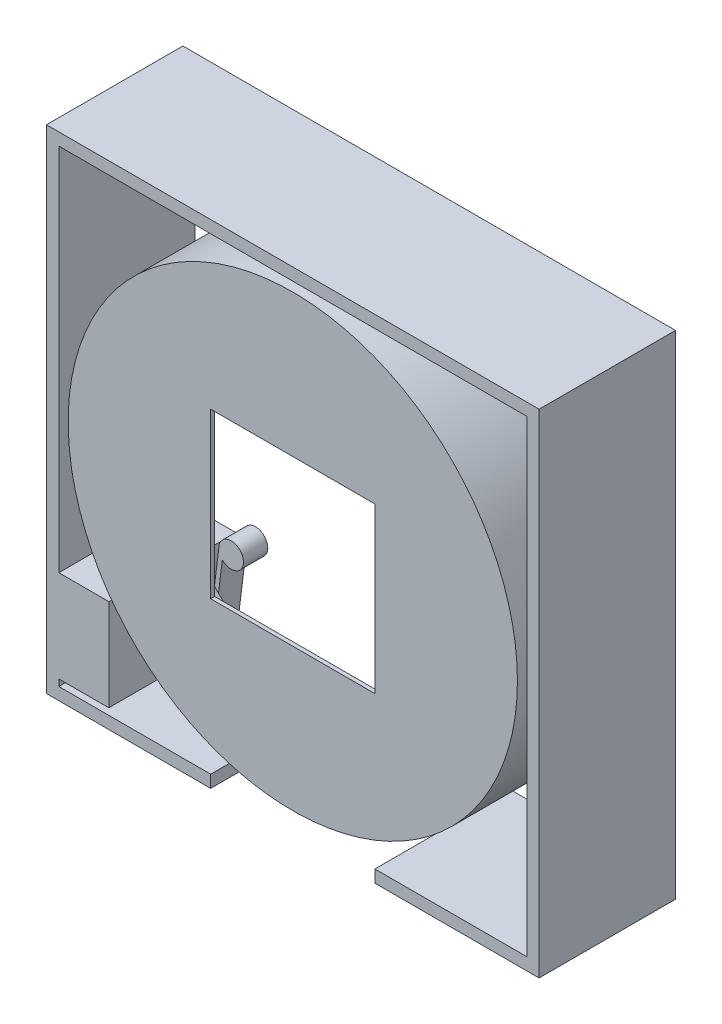
ISO-10303-21;
HEADER;
FILE_DESCRIPTION(('STEP AP214'),'2;1');
FILE_NAME('part.step','',(''),(''),'','','');
FILE_SCHEMA(('AUTOMOTIVE_DESIGN { 1 0 10303 214 1 1 1 1 }'));
ENDSEC;
DATA;
#1=APPLICATION_CONTEXT('core data for automotive mechanical design processes');
#2=APPLICATION_PROTOCOL_DEFINITION('international standard','automotive_design',2000,#1);
#3=PRODUCT_CONTEXT('',#1,'mechanical');
#4=PRODUCT('Part','Part','',(#3));
#5=PRODUCT_RELATED_PRODUCT_CATEGORY('part','',(#4));
#6=PRODUCT_DEFINITION_FORMATION('','',#4);
#7=PRODUCT_DEFINITION_CONTEXT('part definition',#1,'design');
#8=PRODUCT_DEFINITION('design','',#6,#7);
#9=PRODUCT_DEFINITION_SHAPE('','',#8);
#10=(LENGTH_UNIT() NAMED_UNIT(*) SI_UNIT(.MILLI.,.METRE.));
#11=(NAMED_UNIT(*) PLANE_ANGLE_UNIT() SI_UNIT($,.RADIAN.));
#12=(NAMED_UNIT(*) SI_UNIT($,.STERADIAN.) SOLID_ANGLE_UNIT());
#13=UNCERTAINTY_MEASURE_WITH_UNIT(LENGTH_MEASURE(1.E-05),#10,'distance_accuracy_value','');
#14=(GEOMETRIC_REPRESENTATION_CONTEXT(3) GLOBAL_UNCERTAINTY_ASSIGNED_CONTEXT((#13)) GLOBAL_UNIT_ASSIGNED_CONTEXT((#10,
#11,#12)) REPRESENTATION_CONTEXT('',''));
#15=CARTESIAN_POINT('',(0.,0.,0.));
#16=DIRECTION('',(0.,0.,1.));
#17=DIRECTION('',(1.,0.,0.));
#18=AXIS2_PLACEMENT_3D('',#15,#16,#17);
#19=CARTESIAN_POINT('',(0.,0.,-19.1379230769231));
#20=DIRECTION('',(0.,0.,1.));
#21=DIRECTION('',(1.,0.,0.));
#22=AXIS2_PLACEMENT_3D('',#19,#20,#21);
#23=PLANE('',#22);
#24=DIRECTION('',(0.,-1.,0.));
#25=VECTOR('',#24,1.);
#26=CARTESIAN_POINT('',(-44.98975,0.,-19.1379230769231));
#27=LINE('',#26,#25);
#28=CARTESIAN_POINT('',(-44.98975,-26.19375,-19.1379230769231));
#29=VERTEX_POINT('',#28);
#30=CARTESIAN_POINT('',(-44.98975,-43.97375,-19.1379230769231));
#31=VERTEX_POINT('',#30);
#32=EDGE_CURVE('E62',#29,#31,#27,.T.);
#33=ORIENTED_EDGE('',*,*,#32,.T.);
#34=DIRECTION('',(1.,0.,0.));
#35=VECTOR('',#34,1.);
#36=CARTESIAN_POINT('',(-45.24375,-43.97375,-19.1379230769231));
#37=LINE('',#36,#35);
#38=CARTESIAN_POINT('',(-45.24375,-43.97375,-19.1379230769231));
#39=VERTEX_POINT('',#38);
#40=EDGE_CURVE('E273',#39,#31,#37,.T.);
#41=ORIENTED_EDGE('',*,*,#40,.F.);
#42=DIRECTION('',(0.,-1.,0.));
#43=VECTOR('',#42,1.);
#44=CARTESIAN_POINT('',(-45.24375,-26.19375,-19.1379230769231));
#45=LINE('',#44,#43);
#46=CARTESIAN_POINT('',(-45.24375,-26.19375,-19.1379230769231));
#47=VERTEX_POINT('',#46);
#48=EDGE_CURVE('E277',#47,#39,#45,.T.);
#49=ORIENTED_EDGE('',*,*,#48,.F.);
#50=DIRECTION('',(-1.,0.,0.));
#51=VECTOR('',#50,1.);
#52=CARTESIAN_POINT('',(-45.24375,-26.19375,-19.1379230769231));
#53=LINE('',#52,#51);
#54=EDGE_CURVE('E268',#29,#47,#53,.T.);
#55=ORIENTED_EDGE('',*,*,#54,.F.);
#56=EDGE_LOOP('',(#33,#41,#49,#55));
#57=FACE_BOUND('',#56,.T.);
#58=ADVANCED_FACE('F45',(#57),#23,.F.);
#59=CARTESIAN_POINT('',(-45.24375,-45.24375,-26.3769230769231));
#60=DIRECTION('',(1.,0.,0.));
#61=DIRECTION('',(0.,1.,0.));
#62=AXIS2_PLACEMENT_3D('',#59,#60,#61);
#63=PLANE('',#62);
#64=ORIENTED_EDGE('',*,*,#48,.T.);
#65=DIRECTION('',(0.,0.,-1.));
#66=VECTOR('',#65,1.);
#67=CARTESIAN_POINT('',(-45.24375,-43.97375,20.2431182720658));
#68=LINE('',#67,#66);
#69=CARTESIAN_POINT('',(-45.24375,-43.97375,0.));
#70=VERTEX_POINT('',#69);
#71=EDGE_CURVE('E276',#70,#39,#68,.T.);
#72=ORIENTED_EDGE('',*,*,#71,.F.);
#73=DIRECTION('',(0.,1.,0.));
#74=VECTOR('',#73,1.);
#75=CARTESIAN_POINT('',(-45.24375,-45.24375,0.));
#76=LINE('',#75,#74);
#77=CARTESIAN_POINT('',(-45.24375,-45.24375,0.));
#78=VERTEX_POINT('',#77);
#79=EDGE_CURVE('E340',#78,#70,#76,.T.);
#80=ORIENTED_EDGE('',*,*,#79,.F.);
#81=DIRECTION('',(0.,0.,1.));
#82=VECTOR('',#81,1.);
#83=CARTESIAN_POINT('',(-45.24375,-45.24375,-26.3769230769231));
#84=LINE('',#83,#82);
#85=CARTESIAN_POINT('',(-45.24375,-45.24375,-26.3769230769231));
#86=VERTEX_POINT('',#85);
#87=EDGE_CURVE('E367',#86,#78,#84,.T.);
#88=ORIENTED_EDGE('',*,*,#87,.F.);
#89=DIRECTION('',(0.,1.,0.));
#90=VECTOR('',#89,1.);
#91=CARTESIAN_POINT('',(-45.24375,-45.24375,-26.3769230769231));
#92=LINE('',#91,#90);
#93=CARTESIAN_POINT('',(-45.24375,45.24375,-26.3769230769231));
#94=VERTEX_POINT('',#93);
#95=EDGE_CURVE('E309',#86,#94,#92,.T.);
#96=ORIENTED_EDGE('',*,*,#95,.T.);
#97=DIRECTION('',(0.,0.,1.));
#98=VECTOR('',#97,1.);
#99=CARTESIAN_POINT('',(-45.24375,45.24375,-26.3769230769231));
#100=LINE('',#99,#98);
#101=CARTESIAN_POINT('',(-45.24375,45.24375,0.));
#102=VERTEX_POINT('',#101);
#103=EDGE_CURVE('E364',#94,#102,#100,.T.);
#104=ORIENTED_EDGE('',*,*,#103,.T.);
#105=CARTESIAN_POINT('',(-45.24375,-26.19375,0.));
#106=VERTEX_POINT('',#105);
#107=EDGE_CURVE('E339',#106,#102,#76,.T.);
#108=ORIENTED_EDGE('',*,*,#107,.F.);
#109=DIRECTION('',(0.,0.,-1.));
#110=VECTOR('',#109,1.);
#111=CARTESIAN_POINT('',(-45.24375,-26.19375,20.2431182720658));
#112=LINE('',#111,#110);
#113=EDGE_CURVE('E259',#106,#47,#112,.T.);
#114=ORIENTED_EDGE('',*,*,#113,.T.);
#115=EDGE_LOOP('',(#64,#72,#80,#88,#96,#104,#108,#114));
#116=FACE_BOUND('',#115,.T.);
#117=ADVANCED_FACE('F416',(#116),#63,.T.);
#118=CARTESIAN_POINT('',(47.625,-47.625,-26.3769230769231));
#119=DIRECTION('',(1.,0.,0.));
#120=DIRECTION('',(0.,0.,-1.));
#121=AXIS2_PLACEMENT_3D('',#118,#119,#120);
#122=PLANE('',#121);
#123=DIRECTION('',(0.,1.,0.));
#124=VECTOR('',#123,1.);
#125=CARTESIAN_POINT('',(47.625,-47.625,0.));
#126=LINE('',#125,#124);
#127=CARTESIAN_POINT('',(47.625,-47.625,0.));
#128=VERTEX_POINT('',#127);
#129=CARTESIAN_POINT('',(47.625,47.625,0.));
#130=VERTEX_POINT('',#129);
#131=EDGE_CURVE('E282',#128,#130,#126,.T.);
#132=ORIENTED_EDGE('',*,*,#131,.F.);
#133=DIRECTION('',(0.,0.,1.));
#134=VECTOR('',#133,1.);
#135=CARTESIAN_POINT('',(47.625,-47.625,-26.3769230769231));
#136=LINE('',#135,#134);
#137=CARTESIAN_POINT('',(47.625,-47.625,-26.3769230769231));
#138=VERTEX_POINT('',#137);
#139=EDGE_CURVE('E12',#138,#128,#136,.T.);
#140=ORIENTED_EDGE('',*,*,#139,.F.);
#141=DIRECTION('',(0.,1.,0.));
#142=VECTOR('',#141,1.);
#143=CARTESIAN_POINT('',(47.625,-47.625,-26.3769230769231));
#144=LINE('',#143,#142);
#145=CARTESIAN_POINT('',(47.625,47.625,-26.3769230769231));
#146=VERTEX_POINT('',#145);
#147=EDGE_CURVE('E293',#138,#146,#144,.T.);
#148=ORIENTED_EDGE('',*,*,#147,.T.);
#149=DIRECTION('',(0.,0.,1.));
#150=VECTOR('',#149,1.);
#151=CARTESIAN_POINT('',(47.625,47.625,-26.3769230769231));
#152=LINE('',#151,#150);
#153=EDGE_CURVE('E49',#146,#130,#152,.T.);
#154=ORIENTED_EDGE('',*,*,#153,.T.);
#155=EDGE_LOOP('',(#132,#140,#148,#154));
#156=FACE_BOUND('',#155,.T.);
#157=ADVANCED_FACE('F47',(#156),#122,.T.);
#158=CARTESIAN_POINT('',(47.625,-47.625,-26.3769230769231));
#159=DIRECTION('',(0.,1.,0.));
#160=DIRECTION('',(0.,0.,1.));
#161=AXIS2_PLACEMENT_3D('',#158,#159,#160);
#162=PLANE('',#161);
#163=DIRECTION('',(-1.,0.,0.));
#164=VECTOR('',#163,1.);
#165=CARTESIAN_POINT('',(47.625,-47.625,0.));
#166=LINE('',#165,#164);
#167=CARTESIAN_POINT('',(15.875,-47.625,0.));
#168=VERTEX_POINT('',#167);
#169=EDGE_CURVE('E297',#128,#168,#166,.T.);
#170=ORIENTED_EDGE('',*,*,#169,.T.);
#171=DIRECTION('',(0.,0.,1.));
#172=VECTOR('',#171,1.);
#173=CARTESIAN_POINT('',(15.875,-47.625,-26.3769230769231));
#174=LINE('',#173,#172);
#175=CARTESIAN_POINT('',(15.875,-47.625,-26.3769230769231));
#176=VERTEX_POINT('',#175);
#177=EDGE_CURVE('E54',#176,#168,#174,.T.);
#178=ORIENTED_EDGE('',*,*,#177,.F.);
#179=DIRECTION('',(-1.,0.,0.));
#180=VECTOR('',#179,1.);
#181=CARTESIAN_POINT('',(47.625,-47.625,-26.3769230769231));
#182=LINE('',#181,#180);
#183=EDGE_CURVE('E322',#138,#176,#182,.T.);
#184=ORIENTED_EDGE('',*,*,#183,.F.);
#185=ORIENTED_EDGE('',*,*,#139,.T.);
#186=EDGE_LOOP('',(#170,#178,#184,#185));
#187=FACE_BOUND('',#186,.T.);
#188=ADVANCED_FACE('F391',(#187),#162,.F.);
#189=CARTESIAN_POINT('',(15.875,-45.24375,-26.3769230769231));
#190=DIRECTION('',(-1.,0.,0.));
#191=DIRECTION('',(0.,0.,1.));
#192=AXIS2_PLACEMENT_3D('',#189,#190,#191);
#193=PLANE('',#192);
#194=DIRECTION('',(0.,-1.,0.));
#195=VECTOR('',#194,1.);
#196=CARTESIAN_POINT('',(15.875,-45.24375,0.));
#197=LINE('',#196,#195);
#198=CARTESIAN_POINT('',(15.875,-45.24375,0.));
#199=VERTEX_POINT('',#198);
#200=EDGE_CURVE('E351',#199,#168,#197,.T.);
#201=ORIENTED_EDGE('',*,*,#200,.F.);
#202=DIRECTION('',(0.,0.,1.));
#203=VECTOR('',#202,1.);
#204=CARTESIAN_POINT('',(15.875,-45.24375,-26.3769230769231));
#205=LINE('',#204,#203);
#206=CARTESIAN_POINT('',(15.875,-45.24375,-26.3769230769231));
#207=VERTEX_POINT('',#206);
#208=EDGE_CURVE('E357',#207,#199,#205,.T.);
#209=ORIENTED_EDGE('',*,*,#208,.F.);
#210=DIRECTION('',(0.,-1.,0.));
#211=VECTOR('',#210,1.);
#212=CARTESIAN_POINT('',(15.875,-45.24375,-26.3769230769231));
#213=LINE('',#212,#211);
#214=EDGE_CURVE('E319',#207,#176,#213,.T.);
#215=ORIENTED_EDGE('',*,*,#214,.T.);
#216=ORIENTED_EDGE('',*,*,#177,.T.);
#217=EDGE_LOOP('',(#201,#209,#215,#216));
#218=FACE_BOUND('',#217,.T.);
#219=ADVANCED_FACE('F607',(#218),#193,.T.);
#220=CARTESIAN_POINT('',(45.24375,-45.24375,-26.3769230769231));
#221=DIRECTION('',(0.,1.,0.));
#222=DIRECTION('',(0.,0.,1.));
#223=AXIS2_PLACEMENT_3D('',#220,#221,#222);
#224=PLANE('',#223);
#225=DIRECTION('',(-1.,0.,0.));
#226=VECTOR('',#225,1.);
#227=CARTESIAN_POINT('',(45.24375,-45.24375,0.));
#228=LINE('',#227,#226);
#229=CARTESIAN_POINT('',(45.24375,-45.24375,0.));
#230=VERTEX_POINT('',#229);
#231=EDGE_CURVE('E348',#230,#199,#228,.T.);
#232=ORIENTED_EDGE('',*,*,#231,.F.);
#233=DIRECTION('',(0.,0.,1.));
#234=VECTOR('',#233,1.);
#235=CARTESIAN_POINT('',(45.24375,-45.24375,-26.3769230769231));
#236=LINE('',#235,#234);
#237=CARTESIAN_POINT('',(45.24375,-45.24375,-26.3769230769231));
#238=VERTEX_POINT('',#237);
#239=EDGE_CURVE('E359',#238,#230,#236,.T.);
#240=ORIENTED_EDGE('',*,*,#239,.F.);
#241=DIRECTION('',(-1.,0.,0.));
#242=VECTOR('',#241,1.);
#243=CARTESIAN_POINT('',(45.24375,-45.24375,-26.3769230769231));
#244=LINE('',#243,#242);
#245=EDGE_CURVE('E316',#238,#207,#244,.T.);
#246=ORIENTED_EDGE('',*,*,#245,.T.);
#247=ORIENTED_EDGE('',*,*,#208,.T.);
#248=EDGE_LOOP('',(#232,#240,#246,#247));
#249=FACE_BOUND('',#248,.T.);
#250=ADVANCED_FACE('F598',(#249),#224,.T.);
#251=CARTESIAN_POINT('',(45.24375,-45.24375,-26.3769230769231));
#252=DIRECTION('',(1.,0.,0.));
#253=DIRECTION('',(0.,0.,-1.));
#254=AXIS2_PLACEMENT_3D('',#251,#252,#253);
#255=PLANE('',#254);
#256=DIRECTION('',(0.,1.,0.));
#257=VECTOR('',#256,1.);
#258=CARTESIAN_POINT('',(45.24375,-45.24375,0.));
#259=LINE('',#258,#257);
#260=CARTESIAN_POINT('',(45.24375,45.24375,0.));
#261=VERTEX_POINT('',#260);
#262=EDGE_CURVE('E346',#230,#261,#259,.T.);
#263=ORIENTED_EDGE('',*,*,#262,.T.);
#264=DIRECTION('',(0.,0.,1.));
#265=VECTOR('',#264,1.);
#266=CARTESIAN_POINT('',(45.24375,45.24375,-26.3769230769231));
#267=LINE('',#266,#265);
#268=CARTESIAN_POINT('',(45.24375,45.24375,-26.3769230769231));
#269=VERTEX_POINT('',#268);
#270=EDGE_CURVE('E361',#269,#261,#267,.T.);
#271=ORIENTED_EDGE('',*,*,#270,.F.);
#272=DIRECTION('',(0.,1.,0.));
#273=VECTOR('',#272,1.);
#274=CARTESIAN_POINT('',(45.24375,-45.24375,-26.3769230769231));
#275=LINE('',#274,#273);
#276=EDGE_CURVE('E314',#238,#269,#275,.T.);
#277=ORIENTED_EDGE('',*,*,#276,.F.);
#278=ORIENTED_EDGE('',*,*,#239,.T.);
#279=EDGE_LOOP('',(#263,#271,#277,#278));
#280=FACE_BOUND('',#279,.T.);
#281=ADVANCED_FACE('F589',(#280),#255,.F.);
#282=CARTESIAN_POINT('',(45.24375,45.24375,-26.3769230769231));
#283=DIRECTION('',(0.,1.,0.));
#284=DIRECTION('',(-1.,0.,0.));
#285=AXIS2_PLACEMENT_3D('',#282,#283,#284);
#286=PLANE('',#285);
#287=DIRECTION('',(-1.,0.,0.));
#288=VECTOR('',#287,1.);
#289=CARTESIAN_POINT('',(45.24375,45.24375,0.));
#290=LINE('',#289,#288);
#291=EDGE_CURVE('E343',#261,#102,#290,.T.);
#292=ORIENTED_EDGE('',*,*,#291,.T.);
#293=ORIENTED_EDGE('',*,*,#103,.F.);
#294=DIRECTION('',(-1.,0.,0.));
#295=VECTOR('',#294,1.);
#296=CARTESIAN_POINT('',(45.24375,45.24375,-26.3769230769231));
#297=LINE('',#296,#295);
#298=EDGE_CURVE('E312',#269,#94,#297,.T.);
#299=ORIENTED_EDGE('',*,*,#298,.F.);
#300=ORIENTED_EDGE('',*,*,#270,.T.);
#301=EDGE_LOOP('',(#292,#293,#299,#300));
#302=FACE_BOUND('',#301,.T.);
#303=ADVANCED_FACE('F581',(#302),#286,.F.);
#304=CARTESIAN_POINT('',(-15.875,-45.24375,-26.3769230769231));
#305=DIRECTION('',(0.,1.,0.));
#306=DIRECTION('',(-1.,0.,0.));
#307=AXIS2_PLACEMENT_3D('',#304,#305,#306);
#308=PLANE('',#307);
#309=DIRECTION('',(-1.,0.,0.));
#310=VECTOR('',#309,1.);
#311=CARTESIAN_POINT('',(-15.875,-45.24375,0.));
#312=LINE('',#311,#310);
#313=CARTESIAN_POINT('',(-15.875,-45.24375,0.));
#314=VERTEX_POINT('',#313);
#315=EDGE_CURVE('E336',#314,#78,#312,.T.);
#316=ORIENTED_EDGE('',*,*,#315,.F.);
#317=DIRECTION('',(0.,0.,1.));
#318=VECTOR('',#317,1.);
#319=CARTESIAN_POINT('',(-15.875,-45.24375,-26.3769230769231));
#320=LINE('',#319,#318);
#321=CARTESIAN_POINT('',(-15.875,-45.24375,-26.3769230769231));
#322=VERTEX_POINT('',#321);
#323=EDGE_CURVE('E369',#322,#314,#320,.T.);
#324=ORIENTED_EDGE('',*,*,#323,.F.);
#325=DIRECTION('',(-1.,0.,0.));
#326=VECTOR('',#325,1.);
#327=CARTESIAN_POINT('',(-15.875,-45.24375,-26.3769230769231));
#328=LINE('',#327,#326);
#329=EDGE_CURVE('E306',#322,#86,#328,.T.);
#330=ORIENTED_EDGE('',*,*,#329,.T.);
#331=ORIENTED_EDGE('',*,*,#87,.T.);
#332=EDGE_LOOP('',(#316,#324,#330,#331));
#333=FACE_BOUND('',#332,.T.);
#334=ADVANCED_FACE('F412',(#333),#308,.T.);
#335=CARTESIAN_POINT('',(-15.875,-45.24375,-26.3769230769231));
#336=DIRECTION('',(-1.,0.,0.));
#337=DIRECTION('',(0.,0.,1.));
#338=AXIS2_PLACEMENT_3D('',#335,#336,#337);
#339=PLANE('',#338);
#340=DIRECTION('',(0.,-1.,0.));
#341=VECTOR('',#340,1.);
#342=CARTESIAN_POINT('',(-15.875,-45.24375,0.));
#343=LINE('',#342,#341);
#344=CARTESIAN_POINT('',(-15.875,-47.625,0.));
#345=VERTEX_POINT('',#344);
#346=EDGE_CURVE('E334',#314,#345,#343,.T.);
#347=ORIENTED_EDGE('',*,*,#346,.T.);
#348=DIRECTION('',(0.,0.,1.));
#349=VECTOR('',#348,1.);
#350=CARTESIAN_POINT('',(-15.875,-47.625,-26.3769230769231));
#351=LINE('',#350,#349);
#352=CARTESIAN_POINT('',(-15.875,-47.625,-26.3769230769231));
#353=VERTEX_POINT('',#352);
#354=EDGE_CURVE('E371',#353,#345,#351,.T.);
#355=ORIENTED_EDGE('',*,*,#354,.F.);
#356=DIRECTION('',(0.,-1.,0.));
#357=VECTOR('',#356,1.);
#358=CARTESIAN_POINT('',(-15.875,-45.24375,-26.3769230769231));
#359=LINE('',#358,#357);
#360=EDGE_CURVE('E304',#322,#353,#359,.T.);
#361=ORIENTED_EDGE('',*,*,#360,.F.);
#362=ORIENTED_EDGE('',*,*,#323,.T.);
#363=EDGE_LOOP('',(#347,#355,#361,#362));
#364=FACE_BOUND('',#363,.T.);
#365=ADVANCED_FACE('F409',(#364),#339,.F.);
#366=CARTESIAN_POINT('',(-15.875,-47.625,-26.3769230769231));
#367=DIRECTION('',(0.,1.,0.));
#368=DIRECTION('',(-1.,0.,0.));
#369=AXIS2_PLACEMENT_3D('',#366,#367,#368);
#370=PLANE('',#369);
#371=DIRECTION('',(-1.,0.,0.));
#372=VECTOR('',#371,1.);
#373=CARTESIAN_POINT('',(-15.875,-47.625,0.));
#374=LINE('',#373,#372);
#375=CARTESIAN_POINT('',(-47.625,-47.625,0.));
#376=VERTEX_POINT('',#375);
#377=EDGE_CURVE('E332',#345,#376,#374,.T.);
#378=ORIENTED_EDGE('',*,*,#377,.T.);
#379=DIRECTION('',(0.,0.,1.));
#380=VECTOR('',#379,1.);
#381=CARTESIAN_POINT('',(-47.625,-47.625,-26.3769230769231));
#382=LINE('',#381,#380);
#383=CARTESIAN_POINT('',(-47.625,-47.625,-26.3769230769231));
#384=VERTEX_POINT('',#383);
#385=EDGE_CURVE('E374',#384,#376,#382,.T.);
#386=ORIENTED_EDGE('',*,*,#385,.F.);
#387=DIRECTION('',(-1.,0.,0.));
#388=VECTOR('',#387,1.);
#389=CARTESIAN_POINT('',(-15.875,-47.625,-26.3769230769231));
#390=LINE('',#389,#388);
#391=EDGE_CURVE('E302',#353,#384,#390,.T.);
#392=ORIENTED_EDGE('',*,*,#391,.F.);
#393=ORIENTED_EDGE('',*,*,#354,.T.);
#394=EDGE_LOOP('',(#378,#386,#392,#393));
#395=FACE_BOUND('',#394,.T.);
#396=ADVANCED_FACE('F405',(#395),#370,.F.);
#397=CARTESIAN_POINT('',(-47.625,-47.625,-26.3769230769231));
#398=DIRECTION('',(1.,0.,0.));
#399=DIRECTION('',(0.,0.,-1.));
#400=AXIS2_PLACEMENT_3D('',#397,#398,#399);
#401=PLANE('',#400);
#402=DIRECTION('',(0.,1.,0.));
#403=VECTOR('',#402,1.);
#404=CARTESIAN_POINT('',(-47.625,-47.625,0.));
#405=LINE('',#404,#403);
#406=CARTESIAN_POINT('',(-47.625,47.625,0.));
#407=VERTEX_POINT('',#406);
#408=EDGE_CURVE('E329',#376,#407,#405,.T.);
#409=ORIENTED_EDGE('',*,*,#408,.T.);
#410=DIRECTION('',(0.,0.,1.));
#411=VECTOR('',#410,1.);
#412=CARTESIAN_POINT('',(-47.625,47.625,-26.3769230769231));
#413=LINE('',#412,#411);
#414=CARTESIAN_POINT('',(-47.625,47.625,-26.3769230769231));
#415=VERTEX_POINT('',#414);
#416=EDGE_CURVE('E376',#415,#407,#413,.T.);
#417=ORIENTED_EDGE('',*,*,#416,.F.);
#418=DIRECTION('',(0.,1.,0.));
#419=VECTOR('',#418,1.);
#420=CARTESIAN_POINT('',(-47.625,-47.625,-26.3769230769231));
#421=LINE('',#420,#419);
#422=EDGE_CURVE('E300',#384,#415,#421,.T.);
#423=ORIENTED_EDGE('',*,*,#422,.F.);
#424=ORIENTED_EDGE('',*,*,#385,.T.);
#425=EDGE_LOOP('',(#409,#417,#423,#424));
#426=FACE_BOUND('',#425,.T.);
#427=ADVANCED_FACE('F400',(#426),#401,.F.);
#428=CARTESIAN_POINT('',(47.625,47.625,-26.3769230769231));
#429=DIRECTION('',(0.,1.,0.));
#430=DIRECTION('',(-1.,0.,0.));
#431=AXIS2_PLACEMENT_3D('',#428,#429,#430);
#432=PLANE('',#431);
#433=DIRECTION('',(-1.,0.,0.));
#434=VECTOR('',#433,1.);
#435=CARTESIAN_POINT('',(47.625,47.625,0.));
#436=LINE('',#435,#434);
#437=EDGE_CURVE('E326',#130,#407,#436,.T.);
#438=ORIENTED_EDGE('',*,*,#437,.F.);
#439=ORIENTED_EDGE('',*,*,#153,.F.);
#440=DIRECTION('',(-1.,0.,0.));
#441=VECTOR('',#440,1.);
#442=CARTESIAN_POINT('',(47.625,47.625,-26.3769230769231));
#443=LINE('',#442,#441);
#444=EDGE_CURVE('E296',#146,#415,#443,.T.);
#445=ORIENTED_EDGE('',*,*,#444,.T.);
#446=ORIENTED_EDGE('',*,*,#416,.T.);
#447=EDGE_LOOP('',(#438,#439,#445,#446));
#448=FACE_BOUND('',#447,.T.);
#449=ADVANCED_FACE('F384',(#448),#432,.T.);
#450=CARTESIAN_POINT('',(0.,0.,-26.3769230769231));
#451=DIRECTION('',(0.,0.,1.));
#452=DIRECTION('',(1.,0.,0.));
#453=AXIS2_PLACEMENT_3D('',#450,#451,#452);
#454=PLANE('',#453);
#455=ORIENTED_EDGE('',*,*,#147,.F.);
#456=ORIENTED_EDGE('',*,*,#183,.T.);
#457=ORIENTED_EDGE('',*,*,#214,.F.);
#458=ORIENTED_EDGE('',*,*,#245,.F.);
#459=ORIENTED_EDGE('',*,*,#276,.T.);
#460=ORIENTED_EDGE('',*,*,#298,.T.);
#461=ORIENTED_EDGE('',*,*,#95,.F.);
#462=ORIENTED_EDGE('',*,*,#329,.F.);
#463=ORIENTED_EDGE('',*,*,#360,.T.);
#464=ORIENTED_EDGE('',*,*,#391,.T.);
#465=ORIENTED_EDGE('',*,*,#422,.T.);
#466=ORIENTED_EDGE('',*,*,#444,.F.);
#467=EDGE_LOOP('',(#455,#456,#457,#458,#459,#460,#461,#462,#463,#464,#465,#466));
#468=FACE_BOUND('',#467,.T.);
#469=ADVANCED_FACE('F395',(#468),#454,.F.);
#470=CARTESIAN_POINT('',(0.,0.,0.));
#471=DIRECTION('',(0.,0.,1.));
#472=DIRECTION('',(1.,0.,0.));
#473=AXIS2_PLACEMENT_3D('',#470,#471,#472);
#474=PLANE('',#473);
#475=ORIENTED_EDGE('',*,*,#131,.T.);
#476=ORIENTED_EDGE('',*,*,#437,.T.);
#477=ORIENTED_EDGE('',*,*,#408,.F.);
#478=ORIENTED_EDGE('',*,*,#377,.F.);
#479=ORIENTED_EDGE('',*,*,#346,.F.);
#480=ORIENTED_EDGE('',*,*,#315,.T.);
#481=ORIENTED_EDGE('',*,*,#79,.T.);
#482=DIRECTION('',(1.,0.,0.));
#483=VECTOR('',#482,1.);
#484=CARTESIAN_POINT('',(-45.24375,-43.97375,0.));
#485=LINE('',#484,#483);
#486=CARTESIAN_POINT('',(-35.566176059345,-43.97375,0.));
#487=VERTEX_POINT('',#486);
#488=EDGE_CURVE('E283',#70,#487,#485,.T.);
#489=ORIENTED_EDGE('',*,*,#488,.T.);
#490=DIRECTION('',(0.,1.,0.));
#491=VECTOR('',#490,1.);
#492=CARTESIAN_POINT('',(-35.566176059345,-26.19375,0.));
#493=LINE('',#492,#491);
#494=CARTESIAN_POINT('',(-35.566176059345,-26.19375,0.));
#495=VERTEX_POINT('',#494);
#496=EDGE_CURVE('E280',#487,#495,#493,.T.);
#497=ORIENTED_EDGE('',*,*,#496,.T.);
#498=DIRECTION('',(-1.,0.,0.));
#499=VECTOR('',#498,1.);
#500=CARTESIAN_POINT('',(-45.24375,-26.19375,0.));
#501=LINE('',#500,#499);
#502=EDGE_CURVE('E70',#495,#106,#501,.T.);
#503=ORIENTED_EDGE('',*,*,#502,.T.);
#504=ORIENTED_EDGE('',*,*,#107,.T.);
#505=ORIENTED_EDGE('',*,*,#291,.F.);
#506=ORIENTED_EDGE('',*,*,#262,.F.);
#507=ORIENTED_EDGE('',*,*,#231,.T.);
#508=ORIENTED_EDGE('',*,*,#200,.T.);
#509=ORIENTED_EDGE('',*,*,#169,.F.);
#510=EDGE_LOOP('',(#475,#476,#477,#478,#479,#480,#481,#489,#497,#503,#504,#505,#506,#507,#508,#509));
#511=FACE_BOUND('',#510,.T.);
#512=ADVANCED_FACE('F387',(#511),#474,.T.);
#513=CARTESIAN_POINT('',(-45.24375,-43.97375,20.2431182720658));
#514=DIRECTION('',(0.,1.,0.));
#515=DIRECTION('',(0.,0.,1.));
#516=AXIS2_PLACEMENT_3D('',#513,#514,#515);
#517=PLANE('',#516);
#518=ORIENTED_EDGE('',*,*,#488,.F.);
#519=ORIENTED_EDGE('',*,*,#71,.T.);
#520=ORIENTED_EDGE('',*,*,#40,.T.);
#521=DIRECTION('',(0.,0.,-1.));
#522=VECTOR('',#521,1.);
#523=CARTESIAN_POINT('',(-44.98975,-43.97375,-19.1379230769231));
#524=LINE('',#523,#522);
#525=CARTESIAN_POINT('',(-44.98975,-43.97375,-23.8369230769231));
#526=VERTEX_POINT('',#525);
#527=EDGE_CURVE('E257',#31,#526,#524,.T.);
#528=ORIENTED_EDGE('',*,*,#527,.T.);
#529=DIRECTION('',(-1.,0.,0.));
#530=VECTOR('',#529,1.);
#531=CARTESIAN_POINT('',(0.,-43.97375,-23.8369230769231));
#532=LINE('',#531,#530);
#533=CARTESIAN_POINT('',(-34.82975,-43.97375,-23.8369230769231));
#534=VERTEX_POINT('',#533);
#535=EDGE_CURVE('E254',#534,#526,#532,.T.);
#536=ORIENTED_EDGE('',*,*,#535,.F.);
#537=DIRECTION('',(0.,0.,-1.));
#538=VECTOR('',#537,1.);
#539=CARTESIAN_POINT('',(-34.82975,-43.97375,-19.1379230769231));
#540=LINE('',#539,#538);
#541=CARTESIAN_POINT('',(-34.82975,-43.97375,-19.1379230769231));
#542=VERTEX_POINT('',#541);
#543=EDGE_CURVE('E260',#542,#534,#540,.T.);
#544=ORIENTED_EDGE('',*,*,#543,.F.);
#545=DIRECTION('',(-1.,0.,0.));
#546=VECTOR('',#545,1.);
#547=CARTESIAN_POINT('',(0.,-43.97375,-19.1379230769231));
#548=LINE('',#547,#546);
#549=CARTESIAN_POINT('',(-35.566176059345,-43.97375,-19.1379230769231));
#550=VERTEX_POINT('',#549);
#551=EDGE_CURVE('E236',#542,#550,#548,.T.);
#552=ORIENTED_EDGE('',*,*,#551,.T.);
#553=DIRECTION('',(0.,0.,-1.));
#554=VECTOR('',#553,1.);
#555=CARTESIAN_POINT('',(-35.566176059345,-43.97375,20.2431182720658));
#556=LINE('',#555,#554);
#557=EDGE_CURVE('E272',#487,#550,#556,.T.);
#558=ORIENTED_EDGE('',*,*,#557,.F.);
#559=EDGE_LOOP('',(#518,#519,#520,#528,#536,#544,#552,#558));
#560=FACE_BOUND('',#559,.T.);
#561=ADVANCED_FACE('F421',(#560),#517,.F.);
#562=CARTESIAN_POINT('',(-35.566176059345,-26.19375,20.2431182720658));
#563=DIRECTION('',(-1.,0.,0.));
#564=DIRECTION('',(0.,0.,1.));
#565=AXIS2_PLACEMENT_3D('',#562,#563,#564);
#566=PLANE('',#565);
#567=ORIENTED_EDGE('',*,*,#496,.F.);
#568=ORIENTED_EDGE('',*,*,#557,.T.);
#569=DIRECTION('',(0.,1.,0.));
#570=VECTOR('',#569,1.);
#571=CARTESIAN_POINT('',(-35.566176059345,-26.19375,-19.1379230769231));
#572=LINE('',#571,#570);
#573=CARTESIAN_POINT('',(-35.566176059345,-26.19375,-19.1379230769231));
#574=VERTEX_POINT('',#573);
#575=EDGE_CURVE('E270',#550,#574,#572,.T.);
#576=ORIENTED_EDGE('',*,*,#575,.T.);
#577=DIRECTION('',(0.,0.,-1.));
#578=VECTOR('',#577,1.);
#579=CARTESIAN_POINT('',(-35.566176059345,-26.19375,20.2431182720658));
#580=LINE('',#579,#578);
#581=EDGE_CURVE('E218',#495,#574,#580,.T.);
#582=ORIENTED_EDGE('',*,*,#581,.F.);
#583=EDGE_LOOP('',(#567,#568,#576,#582));
#584=FACE_BOUND('',#583,.T.);
#585=ADVANCED_FACE('F438',(#584),#566,.F.);
#586=CARTESIAN_POINT('',(-45.24375,-26.19375,20.2431182720658));
#587=DIRECTION('',(0.,-1.,0.));
#588=DIRECTION('',(0.,0.,-1.));
#589=AXIS2_PLACEMENT_3D('',#586,#587,#588);
#590=PLANE('',#589);
#591=ORIENTED_EDGE('',*,*,#502,.F.);
#592=ORIENTED_EDGE('',*,*,#581,.T.);
#593=DIRECTION('',(-1.,0.,0.));
#594=VECTOR('',#593,1.);
#595=CARTESIAN_POINT('',(0.,-26.19375,-19.1379230769231));
#596=LINE('',#595,#594);
#597=CARTESIAN_POINT('',(-34.82975,-26.19375,-19.1379230769231));
#598=VERTEX_POINT('',#597);
#599=EDGE_CURVE('E216',#598,#574,#596,.T.);
#600=ORIENTED_EDGE('',*,*,#599,.F.);
#601=DIRECTION('',(0.,0.,-1.));
#602=VECTOR('',#601,1.);
#603=CARTESIAN_POINT('',(-34.82975,-26.19375,-19.1379230769231));
#604=LINE('',#603,#602);
#605=CARTESIAN_POINT('',(-34.82975,-26.19375,-23.8369230769231));
#606=VERTEX_POINT('',#605);
#607=EDGE_CURVE('E203',#598,#606,#604,.T.);
#608=ORIENTED_EDGE('',*,*,#607,.T.);
#609=DIRECTION('',(-1.,0.,0.));
#610=VECTOR('',#609,1.);
#611=CARTESIAN_POINT('',(0.,-26.19375,-23.8369230769231));
#612=LINE('',#611,#610);
#613=CARTESIAN_POINT('',(-44.98975,-26.19375,-23.8369230769231));
#614=VERTEX_POINT('',#613);
#615=EDGE_CURVE('E242',#606,#614,#612,.T.);
#616=ORIENTED_EDGE('',*,*,#615,.T.);
#617=DIRECTION('',(0.,0.,-1.));
#618=VECTOR('',#617,1.);
#619=CARTESIAN_POINT('',(-44.98975,-26.19375,-19.1379230769231));
#620=LINE('',#619,#618);
#621=EDGE_CURVE('E213',#29,#614,#620,.T.);
#622=ORIENTED_EDGE('',*,*,#621,.F.);
#623=ORIENTED_EDGE('',*,*,#54,.T.);
#624=ORIENTED_EDGE('',*,*,#113,.F.);
#625=EDGE_LOOP('',(#591,#592,#600,#608,#616,#622,#623,#624));
#626=FACE_BOUND('',#625,.T.);
#627=ADVANCED_FACE('F217',(#626),#590,.F.);
#628=CARTESIAN_POINT('',(0.,0.,-19.1379230769231));
#629=DIRECTION('',(0.,0.,-1.));
#630=DIRECTION('',(-1.,0.,0.));
#631=AXIS2_PLACEMENT_3D('',#628,#629,#630);
#632=PLANE('',#631);
#633=ORIENTED_EDGE('',*,*,#599,.T.);
#634=ORIENTED_EDGE('',*,*,#575,.F.);
#635=ORIENTED_EDGE('',*,*,#551,.F.);
#636=DIRECTION('',(0.123264387730611,0.992373866401871,0.));
#637=VECTOR('',#636,1.);
#638=CARTESIAN_POINT('',(-28.9214822767437,3.59238481161377,-19.1379230769231));
#639=LINE('',#638,#637);
#640=CARTESIAN_POINT('',(-32.765891315195,-27.3580878411687,-19.1379230769231));
#641=VERTEX_POINT('',#640);
#642=EDGE_CURVE('E234',#542,#641,#639,.T.);
#643=ORIENTED_EDGE('',*,*,#642,.T.);
#644=CARTESIAN_POINT('',(-31.0555301225557,-25.701278813787,-19.1379230769231));
#645=DIRECTION('',(0.,0.,-1.));
#646=DIRECTION('',(-1.,0.,0.));
#647=AXIS2_PLACEMENT_3D('',#644,#645,#646);
#648=CIRCLE('',#647,2.38125);
#649=CARTESIAN_POINT('',(-33.4367801225557,-25.701278813787,-19.1379230769231));
#650=VERTEX_POINT('',#649);
#651=EDGE_CURVE('E228',#650,#641,#648,.T.);
#652=ORIENTED_EDGE('',*,*,#651,.F.);
#653=DIRECTION('',(-0.123264387730611,-0.992373866401871,0.));
#654=VECTOR('',#653,1.);
#655=CARTESIAN_POINT('',(-29.7848456252645,3.6996245910432,-19.1379230769231));
#656=LINE('',#655,#654);
#657=CARTESIAN_POINT('',(-34.82975,-36.9157660514296,-19.1379230769231));
#658=VERTEX_POINT('',#657);
#659=EDGE_CURVE('E225',#650,#658,#656,.T.);
#660=ORIENTED_EDGE('',*,*,#659,.T.);
#661=DIRECTION('',(0.,-1.,0.));
#662=VECTOR('',#661,1.);
#663=CARTESIAN_POINT('',(-34.82975,0.,-19.1379230769231));
#664=LINE('',#663,#662);
#665=EDGE_CURVE('E207',#598,#658,#664,.T.);
#666=ORIENTED_EDGE('',*,*,#665,.F.);
#667=EDGE_LOOP('',(#633,#634,#635,#643,#652,#660,#666));
#668=FACE_BOUND('',#667,.T.);
#669=ADVANCED_FACE('F222',(#668),#632,.F.);
#670=CARTESIAN_POINT('',(-44.98975,0.,-19.1379230769231));
#671=DIRECTION('',(1.,0.,0.));
#672=DIRECTION('',(0.,0.,-1.));
#673=AXIS2_PLACEMENT_3D('',#670,#671,#672);
#674=PLANE('',#673);
#675=DIRECTION('',(0.,-1.,0.));
#676=VECTOR('',#675,1.);
#677=CARTESIAN_POINT('',(-44.98975,0.,-23.8369230769231));
#678=LINE('',#677,#676);
#679=EDGE_CURVE('E239',#614,#526,#678,.T.);
#680=ORIENTED_EDGE('',*,*,#679,.T.);
#681=ORIENTED_EDGE('',*,*,#527,.F.);
#682=ORIENTED_EDGE('',*,*,#32,.F.);
#683=ORIENTED_EDGE('',*,*,#621,.T.);
#684=EDGE_LOOP('',(#680,#681,#682,#683));
#685=FACE_BOUND('',#684,.T.);
#686=ADVANCED_FACE('F427',(#685),#674,.F.);
#687=CARTESIAN_POINT('',(-28.9214822767437,3.59238481161377,-19.1379230769231));
#688=DIRECTION('',(-0.992373866401871,0.123264387730611,0.));
#689=DIRECTION('',(-0.123264387730611,-0.992373866401871,0.));
#690=AXIS2_PLACEMENT_3D('',#687,#688,#689);
#691=PLANE('',#690);
#692=DIRECTION('',(0.123264387730611,0.992373866401871,0.));
#693=VECTOR('',#692,1.);
#694=CARTESIAN_POINT('',(-28.9214822767437,3.59238481161377,-23.8369230769231));
#695=LINE('',#694,#693);
#696=CARTESIAN_POINT('',(-32.765891315195,-27.3580878411687,-23.8369230769231));
#697=VERTEX_POINT('',#696);
#698=EDGE_CURVE('E251',#534,#697,#695,.T.);
#699=ORIENTED_EDGE('',*,*,#698,.T.);
#700=DIRECTION('',(0.,0.,-1.));
#701=VECTOR('',#700,1.);
#702=CARTESIAN_POINT('',(-32.765891315195,-27.3580878411687,-19.1379230769231));
#703=LINE('',#702,#701);
#704=EDGE_CURVE('E262',#641,#697,#703,.T.);
#705=ORIENTED_EDGE('',*,*,#704,.F.);
#706=ORIENTED_EDGE('',*,*,#642,.F.);
#707=ORIENTED_EDGE('',*,*,#543,.T.);
#708=EDGE_LOOP('',(#699,#705,#706,#707));
#709=FACE_BOUND('',#708,.T.);
#710=ADVANCED_FACE('F436',(#709),#691,.F.);
#711=CARTESIAN_POINT('',(-31.0555301225557,-25.701278813787,-19.1379230769231));
#712=DIRECTION('',(0.,0.,-1.));
#713=DIRECTION('',(-1.,0.,0.));
#714=AXIS2_PLACEMENT_3D('',#711,#712,#713);
#715=CYLINDRICAL_SURFACE('',#714,2.38125);
#716=CARTESIAN_POINT('',(-31.0555301225557,-25.701278813787,-23.8369230769231));
#717=DIRECTION('',(0.,0.,-1.));
#718=DIRECTION('',(-1.,0.,0.));
#719=AXIS2_PLACEMENT_3D('',#716,#717,#718);
#720=CIRCLE('',#719,2.38125);
#721=CARTESIAN_POINT('',(-33.4367801225557,-25.701278813787,-23.8369230769231));
#722=VERTEX_POINT('',#721);
#723=EDGE_CURVE('E248',#722,#697,#720,.T.);
#724=ORIENTED_EDGE('',*,*,#723,.F.);
#725=DIRECTION('',(0.,0.,-1.));
#726=VECTOR('',#725,1.);
#727=CARTESIAN_POINT('',(-33.4367801225557,-25.701278813787,-19.1379230769231));
#728=LINE('',#727,#726);
#729=EDGE_CURVE('E264',#650,#722,#728,.T.);
#730=ORIENTED_EDGE('',*,*,#729,.F.);
#731=ORIENTED_EDGE('',*,*,#651,.T.);
#732=ORIENTED_EDGE('',*,*,#704,.T.);
#733=EDGE_LOOP('',(#724,#730,#731,#732));
#734=FACE_BOUND('',#733,.T.);
#735=ADVANCED_FACE('F461',(#734),#715,.T.);
#736=CARTESIAN_POINT('',(-29.7848456252645,3.6996245910432,-19.1379230769231));
#737=DIRECTION('',(0.992373866401871,-0.123264387730611,0.));
#738=DIRECTION('',(0.123264387730611,0.992373866401871,0.));
#739=AXIS2_PLACEMENT_3D('',#736,#737,#738);
#740=PLANE('',#739);
#741=DIRECTION('',(-0.123264387730611,-0.992373866401871,0.));
#742=VECTOR('',#741,1.);
#743=CARTESIAN_POINT('',(-29.7848456252645,3.6996245910432,-23.8369230769231));
#744=LINE('',#743,#742);
#745=CARTESIAN_POINT('',(-34.82975,-36.9157660514296,-23.8369230769231));
#746=VERTEX_POINT('',#745);
#747=EDGE_CURVE('E245',#722,#746,#744,.T.);
#748=ORIENTED_EDGE('',*,*,#747,.T.);
#749=DIRECTION('',(0.,0.,-1.));
#750=VECTOR('',#749,1.);
#751=CARTESIAN_POINT('',(-34.82975,-36.9157660514296,-19.1379230769231));
#752=LINE('',#751,#750);
#753=EDGE_CURVE('E212',#658,#746,#752,.T.);
#754=ORIENTED_EDGE('',*,*,#753,.F.);
#755=ORIENTED_EDGE('',*,*,#659,.F.);
#756=ORIENTED_EDGE('',*,*,#729,.T.);
#757=EDGE_LOOP('',(#748,#754,#755,#756));
#758=FACE_BOUND('',#757,.T.);
#759=ADVANCED_FACE('F458',(#758),#740,.F.);
#760=CARTESIAN_POINT('',(-34.82975,0.,-19.1379230769231));
#761=DIRECTION('',(1.,0.,0.));
#762=DIRECTION('',(0.,0.,-1.));
#763=AXIS2_PLACEMENT_3D('',#760,#761,#762);
#764=PLANE('',#763);
#765=DIRECTION('',(0.,-1.,0.));
#766=VECTOR('',#765,1.);
#767=CARTESIAN_POINT('',(-34.82975,0.,-23.8369230769231));
#768=LINE('',#767,#766);
#769=EDGE_CURVE('E209',#606,#746,#768,.T.);
#770=ORIENTED_EDGE('',*,*,#769,.F.);
#771=ORIENTED_EDGE('',*,*,#607,.F.);
#772=ORIENTED_EDGE('',*,*,#665,.T.);
#773=ORIENTED_EDGE('',*,*,#753,.T.);
#774=EDGE_LOOP('',(#770,#771,#772,#773));
#775=FACE_BOUND('',#774,.T.);
#776=ADVANCED_FACE('F205',(#775),#764,.T.);
#777=CARTESIAN_POINT('',(0.,0.,-23.8369230769231));
#778=DIRECTION('',(0.,0.,-1.));
#779=DIRECTION('',(-1.,0.,0.));
#780=AXIS2_PLACEMENT_3D('',#777,#778,#779);
#781=PLANE('',#780);
#782=ORIENTED_EDGE('',*,*,#679,.F.);
#783=ORIENTED_EDGE('',*,*,#615,.F.);
#784=ORIENTED_EDGE('',*,*,#769,.T.);
#785=ORIENTED_EDGE('',*,*,#747,.F.);
#786=ORIENTED_EDGE('',*,*,#723,.T.);
#787=ORIENTED_EDGE('',*,*,#698,.F.);
#788=ORIENTED_EDGE('',*,*,#535,.T.);
#789=EDGE_LOOP('',(#782,#783,#784,#785,#786,#787,#788));
#790=FACE_BOUND('',#789,.T.);
#791=ADVANCED_FACE('F429',(#790),#781,.T.);
#792=CLOSED_SHELL('',(#58,#117,#157,#188,#219,#250,#281,#303,#334,#365,#396,#427,#449,#469,#512,
#561,#585,#627,#669,#686,#710,#735,#759,#776,#791));
#793=MANIFOLD_SOLID_BREP('B2',#792);
#794=CARTESIAN_POINT('',(0.,0.,0.));
#795=DIRECTION('',(0.,0.,1.));
#796=DIRECTION('',(1.,0.,0.));
#797=AXIS2_PLACEMENT_3D('',#794,#795,#796);
#798=CYLINDRICAL_SURFACE('',#797,42.672);
#799=CARTESIAN_POINT('',(0.,0.,-15.875));
#800=DIRECTION('',(0.,0.,1.));
#801=DIRECTION('',(1.,0.,0.));
#802=AXIS2_PLACEMENT_3D('',#799,#800,#801);
#803=CIRCLE('',#802,42.672);
#804=CARTESIAN_POINT('',(12.7,-40.7383061012605,-15.875));
#805=VERTEX_POINT('',#804);
#806=CARTESIAN_POINT('',(-12.7,-40.7383061012605,-15.875));
#807=VERTEX_POINT('',#806);
#808=EDGE_CURVE('E767',#805,#807,#803,.T.);
#809=ORIENTED_EDGE('',*,*,#808,.F.);
#810=DIRECTION('',(0.,0.,1.));
#811=VECTOR('',#810,1.);
#812=CARTESIAN_POINT('',(12.7,-40.7383061012605,0.));
#813=LINE('',#812,#811);
#814=CARTESIAN_POINT('',(12.7,-40.7383061012605,-0.761999999999999));
#815=VERTEX_POINT('',#814);
#816=EDGE_CURVE('E760',#805,#815,#813,.T.);
#817=ORIENTED_EDGE('',*,*,#816,.T.);
#818=CARTESIAN_POINT('',(0.,0.,-0.761999999999999));
#819=DIRECTION('',(0.,0.,1.));
#820=DIRECTION('',(1.,0.,0.));
#821=AXIS2_PLACEMENT_3D('',#818,#819,#820);
#822=CIRCLE('',#821,42.672);
#823=CARTESIAN_POINT('',(-12.7,-40.7383061012605,-0.761999999999999));
#824=VERTEX_POINT('',#823);
#825=EDGE_CURVE('E763',#815,#824,#822,.T.);
#826=ORIENTED_EDGE('',*,*,#825,.T.);
#827=DIRECTION('',(0.,0.,1.));
#828=VECTOR('',#827,1.);
#829=CARTESIAN_POINT('',(-12.7,-40.7383061012605,0.));
#830=LINE('',#829,#828);
#831=EDGE_CURVE('E749',#807,#824,#830,.T.);
#832=ORIENTED_EDGE('',*,*,#831,.F.);
#833=EDGE_LOOP('',(#809,#817,#826,#832));
#834=FACE_BOUND('',#833,.T.);
#835=ADVANCED_FACE('F683',(#834),#798,.F.);
#836=CARTESIAN_POINT('',(42.672,0.,-15.875));
#837=DIRECTION('',(0.,0.,-1.));
#838=DIRECTION('',(-1.,0.,0.));
#839=AXIS2_PLACEMENT_3D('',#836,#837,#838);
#840=PLANE('',#839);
#841=CARTESIAN_POINT('',(0.,0.,-15.875));
#842=DIRECTION('',(0.,0.,1.));
#843=DIRECTION('',(1.,0.,0.));
#844=AXIS2_PLACEMENT_3D('',#841,#842,#843);
#845=CIRCLE('',#844,43.434);
#846=CARTESIAN_POINT('',(12.7,-41.5357960800079,-15.875));
#847=VERTEX_POINT('',#846);
#848=CARTESIAN_POINT('',(-12.7,-41.5357960800079,-15.875));
#849=VERTEX_POINT('',#848);
#850=EDGE_CURVE('E769',#847,#849,#845,.T.);
#851=ORIENTED_EDGE('',*,*,#850,.F.);
#852=DIRECTION('',(0.,-1.,0.));
#853=VECTOR('',#852,1.);
#854=CARTESIAN_POINT('',(12.7,0.,-15.875));
#855=LINE('',#854,#853);
#856=EDGE_CURVE('E807',#805,#847,#855,.T.);
#857=ORIENTED_EDGE('',*,*,#856,.F.);
#858=ORIENTED_EDGE('',*,*,#808,.T.);
#859=DIRECTION('',(0.,-1.,0.));
#860=VECTOR('',#859,1.);
#861=CARTESIAN_POINT('',(-12.7,0.,-15.875));
#862=LINE('',#861,#860);
#863=EDGE_CURVE('E755',#807,#849,#862,.T.);
#864=ORIENTED_EDGE('',*,*,#863,.T.);
#865=EDGE_LOOP('',(#851,#857,#858,#864));
#866=FACE_BOUND('',#865,.T.);
#867=ADVANCED_FACE('F812',(#866),#840,.T.);
#868=CARTESIAN_POINT('',(0.,0.,0.));
#869=DIRECTION('',(0.,0.,1.));
#870=DIRECTION('',(1.,0.,0.));
#871=AXIS2_PLACEMENT_3D('',#868,#869,#870);
#872=CYLINDRICAL_SURFACE('',#871,43.434);
#873=CARTESIAN_POINT('',(0.,0.,0.));
#874=DIRECTION('',(0.,0.,1.));
#875=DIRECTION('',(1.,0.,0.));
#876=AXIS2_PLACEMENT_3D('',#873,#874,#875);
#877=CIRCLE('',#876,43.434);
#878=CARTESIAN_POINT('',(43.434,0.,0.));
#879=VERTEX_POINT('',#878);
#880=EDGE_CURVE('E774',#879,#879,#877,.T.);
#881=ORIENTED_EDGE('',*,*,#880,.F.);
#882=EDGE_LOOP('',(#881));
#883=FACE_BOUND('',#882,.T.);
#884=CARTESIAN_POINT('',(0.,0.,-0.761999999999999));
#885=DIRECTION('',(0.,0.,1.));
#886=DIRECTION('',(1.,0.,0.));
#887=AXIS2_PLACEMENT_3D('',#884,#885,#886);
#888=CIRCLE('',#887,43.434);
#889=CARTESIAN_POINT('',(12.7,-41.5357960800079,-0.761999999999999));
#890=VERTEX_POINT('',#889);
#891=CARTESIAN_POINT('',(-12.7,-41.5357960800079,-0.761999999999999));
#892=VERTEX_POINT('',#891);
#893=EDGE_CURVE('E761',#890,#892,#888,.F.);
#894=ORIENTED_EDGE('',*,*,#893,.F.);
#895=DIRECTION('',(0.,0.,1.));
#896=VECTOR('',#895,1.);
#897=CARTESIAN_POINT('',(12.7,-41.5357960800079,0.));
#898=LINE('',#897,#896);
#899=EDGE_CURVE('E43',#890,#847,#898,.F.);
#900=ORIENTED_EDGE('',*,*,#899,.T.);
#901=ORIENTED_EDGE('',*,*,#850,.T.);
#902=DIRECTION('',(0.,0.,1.));
#903=VECTOR('',#902,1.);
#904=CARTESIAN_POINT('',(-12.7,-41.5357960800079,0.));
#905=LINE('',#904,#903);
#906=EDGE_CURVE('E691',#892,#849,#905,.F.);
#907=ORIENTED_EDGE('',*,*,#906,.F.);
#908=EDGE_LOOP('',(#894,#900,#901,#907));
#909=FACE_BOUND('',#908,.T.);
#910=ADVANCED_FACE('F815',(#883,#909),#872,.T.);
#911=CARTESIAN_POINT('',(0.,0.,-0.761999999999999));
#912=DIRECTION('',(0.,0.,-1.));
#913=DIRECTION('',(-1.,0.,0.));
#914=AXIS2_PLACEMENT_3D('',#911,#912,#913);
#915=PLANE('',#914);
#916=DIRECTION('',(0.,1.,0.));
#917=VECTOR('',#916,1.);
#918=CARTESIAN_POINT('',(-15.875,-15.875,-0.761999999999999));
#919=LINE('',#918,#917);
#920=CARTESIAN_POINT('',(-15.875,-15.875,-0.761999999999999));
#921=VERTEX_POINT('',#920);
#922=CARTESIAN_POINT('',(-15.875,15.875,-0.761999999999999));
#923=VERTEX_POINT('',#922);
#924=EDGE_CURVE('E790',#921,#923,#919,.T.);
#925=ORIENTED_EDGE('',*,*,#924,.F.);
#926=DIRECTION('',(-1.,0.,0.));
#927=VECTOR('',#926,1.);
#928=CARTESIAN_POINT('',(15.875,-15.875,-0.761999999999999));
#929=LINE('',#928,#927);
#930=CARTESIAN_POINT('',(15.875,-15.875,-0.761999999999999));
#931=VERTEX_POINT('',#930);
#932=EDGE_CURVE('E787',#931,#921,#929,.T.);
#933=ORIENTED_EDGE('',*,*,#932,.F.);
#934=DIRECTION('',(0.,1.,0.));
#935=VECTOR('',#934,1.);
#936=CARTESIAN_POINT('',(15.875,-15.875,-0.761999999999999));
#937=LINE('',#936,#935);
#938=CARTESIAN_POINT('',(15.875,15.875,-0.761999999999999));
#939=VERTEX_POINT('',#938);
#940=EDGE_CURVE('E706',#931,#939,#937,.T.);
#941=ORIENTED_EDGE('',*,*,#940,.T.);
#942=DIRECTION('',(-1.,0.,0.));
#943=VECTOR('',#942,1.);
#944=CARTESIAN_POINT('',(15.875,15.875,-0.761999999999999));
#945=LINE('',#944,#943);
#946=EDGE_CURVE('E793',#939,#923,#945,.T.);
#947=ORIENTED_EDGE('',*,*,#946,.T.);
#948=EDGE_LOOP('',(#925,#933,#941,#947));
#949=FACE_BOUND('',#948,.T.);
#950=ORIENTED_EDGE('',*,*,#825,.F.);
#951=DIRECTION('',(0.,-1.,0.));
#952=VECTOR('',#951,1.);
#953=CARTESIAN_POINT('',(12.7,0.,-0.761999999999999));
#954=LINE('',#953,#952);
#955=EDGE_CURVE('E698',#815,#890,#954,.T.);
#956=ORIENTED_EDGE('',*,*,#955,.T.);
#957=ORIENTED_EDGE('',*,*,#893,.T.);
#958=DIRECTION('',(0.,-1.,0.));
#959=VECTOR('',#958,1.);
#960=CARTESIAN_POINT('',(-12.7,0.,-0.761999999999999));
#961=LINE('',#960,#959);
#962=EDGE_CURVE('E752',#824,#892,#961,.T.);
#963=ORIENTED_EDGE('',*,*,#962,.F.);
#964=EDGE_LOOP('',(#950,#956,#957,#963));
#965=FACE_BOUND('',#964,.T.);
#966=ADVANCED_FACE('F685',(#949,#965),#915,.T.);
#967=CARTESIAN_POINT('',(0.,0.,0.));
#968=DIRECTION('',(0.,0.,1.));
#969=DIRECTION('',(1.,0.,0.));
#970=AXIS2_PLACEMENT_3D('',#967,#968,#969);
#971=PLANE('',#970);
#972=ORIENTED_EDGE('',*,*,#880,.T.);
#973=EDGE_LOOP('',(#972));
#974=FACE_BOUND('',#973,.T.);
#975=DIRECTION('',(-1.,0.,0.));
#976=VECTOR('',#975,1.);
#977=CARTESIAN_POINT('',(15.875,15.875,0.));
#978=LINE('',#977,#976);
#979=CARTESIAN_POINT('',(15.875,15.875,0.));
#980=VERTEX_POINT('',#979);
#981=CARTESIAN_POINT('',(-15.875,15.875,0.));
#982=VERTEX_POINT('',#981);
#983=EDGE_CURVE('E802',#980,#982,#978,.T.);
#984=ORIENTED_EDGE('',*,*,#983,.F.);
#985=DIRECTION('',(0.,1.,0.));
#986=VECTOR('',#985,1.);
#987=CARTESIAN_POINT('',(15.875,-15.875,0.));
#988=LINE('',#987,#986);
#989=CARTESIAN_POINT('',(15.875,-15.875,0.));
#990=VERTEX_POINT('',#989);
#991=EDGE_CURVE('E789',#990,#980,#988,.T.);
#992=ORIENTED_EDGE('',*,*,#991,.F.);
#993=DIRECTION('',(-1.,0.,0.));
#994=VECTOR('',#993,1.);
#995=CARTESIAN_POINT('',(15.875,-15.875,0.));
#996=LINE('',#995,#994);
#997=CARTESIAN_POINT('',(-15.875,-15.875,0.));
#998=VERTEX_POINT('',#997);
#999=EDGE_CURVE('E786',#990,#998,#996,.T.);
#1000=ORIENTED_EDGE('',*,*,#999,.T.);
#1001=DIRECTION('',(0.,1.,0.));
#1002=VECTOR('',#1001,1.);
#1003=CARTESIAN_POINT('',(-15.875,-15.875,0.));
#1004=LINE('',#1003,#1002);
#1005=EDGE_CURVE('E799',#998,#982,#1004,.T.);
#1006=ORIENTED_EDGE('',*,*,#1005,.T.);
#1007=EDGE_LOOP('',(#984,#992,#1000,#1006));
#1008=FACE_BOUND('',#1007,.T.);
#1009=ADVANCED_FACE('F838',(#974,#1008),#971,.T.);
#1010=CARTESIAN_POINT('',(15.875,-15.875,0.));
#1011=DIRECTION('',(-1.,0.,0.));
#1012=DIRECTION('',(0.,0.,1.));
#1013=AXIS2_PLACEMENT_3D('',#1010,#1011,#1012);
#1014=PLANE('',#1013);
#1015=ORIENTED_EDGE('',*,*,#940,.F.);
#1016=DIRECTION('',(0.,0.,-1.));
#1017=VECTOR('',#1016,1.);
#1018=CARTESIAN_POINT('',(15.875,-15.875,0.));
#1019=LINE('',#1018,#1017);
#1020=EDGE_CURVE('E784',#990,#931,#1019,.T.);
#1021=ORIENTED_EDGE('',*,*,#1020,.F.);
#1022=ORIENTED_EDGE('',*,*,#991,.T.);
#1023=DIRECTION('',(0.,0.,-1.));
#1024=VECTOR('',#1023,1.);
#1025=CARTESIAN_POINT('',(15.875,15.875,0.));
#1026=LINE('',#1025,#1024);
#1027=EDGE_CURVE('E777',#980,#939,#1026,.T.);
#1028=ORIENTED_EDGE('',*,*,#1027,.T.);
#1029=EDGE_LOOP('',(#1015,#1021,#1022,#1028));
#1030=FACE_BOUND('',#1029,.T.);
#1031=ADVANCED_FACE('F841',(#1030),#1014,.T.);
#1032=CARTESIAN_POINT('',(15.875,15.875,0.));
#1033=DIRECTION('',(0.,-1.,0.));
#1034=DIRECTION('',(0.,0.,-1.));
#1035=AXIS2_PLACEMENT_3D('',#1032,#1033,#1034);
#1036=PLANE('',#1035);
#1037=ORIENTED_EDGE('',*,*,#946,.F.);
#1038=ORIENTED_EDGE('',*,*,#1027,.F.);
#1039=ORIENTED_EDGE('',*,*,#983,.T.);
#1040=DIRECTION('',(0.,0.,-1.));
#1041=VECTOR('',#1040,1.);
#1042=CARTESIAN_POINT('',(-15.875,15.875,0.));
#1043=LINE('',#1042,#1041);
#1044=EDGE_CURVE('E779',#982,#923,#1043,.T.);
#1045=ORIENTED_EDGE('',*,*,#1044,.T.);
#1046=EDGE_LOOP('',(#1037,#1038,#1039,#1045));
#1047=FACE_BOUND('',#1046,.T.);
#1048=ADVANCED_FACE('F845',(#1047),#1036,.T.);
#1049=CARTESIAN_POINT('',(-15.875,-15.875,0.));
#1050=DIRECTION('',(-1.,0.,0.));
#1051=DIRECTION('',(0.,0.,1.));
#1052=AXIS2_PLACEMENT_3D('',#1049,#1050,#1051);
#1053=PLANE('',#1052);
#1054=ORIENTED_EDGE('',*,*,#924,.T.);
#1055=ORIENTED_EDGE('',*,*,#1044,.F.);
#1056=ORIENTED_EDGE('',*,*,#1005,.F.);
#1057=DIRECTION('',(0.,0.,-1.));
#1058=VECTOR('',#1057,1.);
#1059=CARTESIAN_POINT('',(-15.875,-15.875,0.));
#1060=LINE('',#1059,#1058);
#1061=EDGE_CURVE('E781',#998,#921,#1060,.T.);
#1062=ORIENTED_EDGE('',*,*,#1061,.T.);
#1063=EDGE_LOOP('',(#1054,#1055,#1056,#1062));
#1064=FACE_BOUND('',#1063,.T.);
#1065=ADVANCED_FACE('F826',(#1064),#1053,.F.);
#1066=CARTESIAN_POINT('',(15.875,-15.875,0.));
#1067=DIRECTION('',(0.,-1.,0.));
#1068=DIRECTION('',(0.,0.,-1.));
#1069=AXIS2_PLACEMENT_3D('',#1066,#1067,#1068);
#1070=PLANE('',#1069);
#1071=ORIENTED_EDGE('',*,*,#932,.T.);
#1072=ORIENTED_EDGE('',*,*,#1061,.F.);
#1073=ORIENTED_EDGE('',*,*,#999,.F.);
#1074=ORIENTED_EDGE('',*,*,#1020,.T.);
#1075=EDGE_LOOP('',(#1071,#1072,#1073,#1074));
#1076=FACE_BOUND('',#1075,.T.);
#1077=ADVANCED_FACE('F819',(#1076),#1070,.F.);
#1078=CARTESIAN_POINT('',(12.7,0.,-15.875));
#1079=DIRECTION('',(-1.,0.,0.));
#1080=DIRECTION('',(0.,-1.,0.));
#1081=AXIS2_PLACEMENT_3D('',#1078,#1079,#1080);
#1082=PLANE('',#1081);
#1083=ORIENTED_EDGE('',*,*,#856,.T.);
#1084=ORIENTED_EDGE('',*,*,#899,.F.);
#1085=ORIENTED_EDGE('',*,*,#955,.F.);
#1086=ORIENTED_EDGE('',*,*,#816,.F.);
#1087=EDGE_LOOP('',(#1083,#1084,#1085,#1086));
#1088=FACE_BOUND('',#1087,.T.);
#1089=ADVANCED_FACE('F817',(#1088),#1082,.T.);
#1090=CARTESIAN_POINT('',(-12.7,0.,-15.875));
#1091=DIRECTION('',(-1.,0.,0.));
#1092=DIRECTION('',(0.,-1.,0.));
#1093=AXIS2_PLACEMENT_3D('',#1090,#1091,#1092);
#1094=PLANE('',#1093);
#1095=ORIENTED_EDGE('',*,*,#831,.T.);
#1096=ORIENTED_EDGE('',*,*,#962,.T.);
#1097=ORIENTED_EDGE('',*,*,#906,.T.);
#1098=ORIENTED_EDGE('',*,*,#863,.F.);
#1099=EDGE_LOOP('',(#1095,#1096,#1097,#1098));
#1100=FACE_BOUND('',#1099,.T.);
#1101=ADVANCED_FACE('F751',(#1100),#1094,.F.);
#1102=CLOSED_SHELL('',(#835,#867,#910,#966,#1009,#1031,#1048,#1065,#1077,#1089,#1101));
#1103=MANIFOLD_SOLID_BREP('B6',#1102);
#1104=ADVANCED_BREP_SHAPE_REPRESENTATION('',(#18,#793,#1103),#14);
#1105=SHAPE_DEFINITION_REPRESENTATION(#9,#1104);
ENDSEC;
END-ISO-10303-21;
